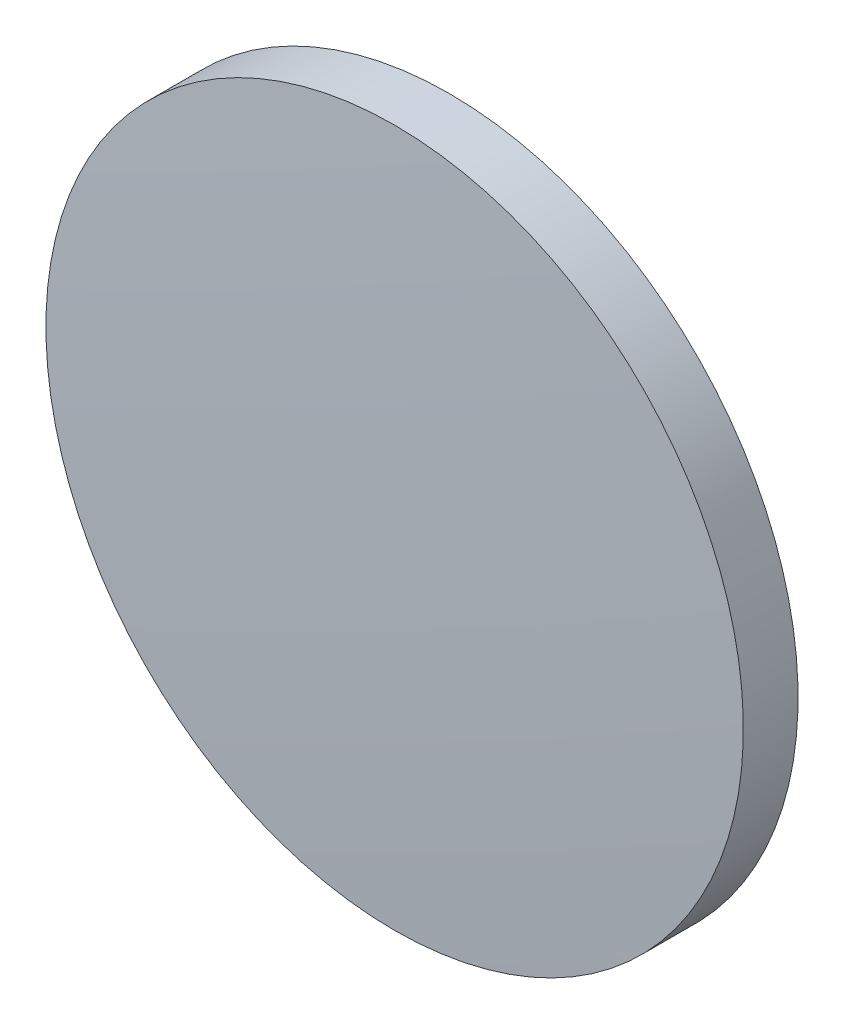
ISO-10303-21;
HEADER;
FILE_DESCRIPTION(('STEP AP214'),'2;1');
FILE_NAME('part.step','',(''),(''),'','','');
FILE_SCHEMA(('AUTOMOTIVE_DESIGN { 1 0 10303 214 1 1 1 1 }'));
ENDSEC;
DATA;
#1=APPLICATION_CONTEXT('core data for automotive mechanical design processes');
#2=APPLICATION_PROTOCOL_DEFINITION('international standard','automotive_design',2000,#1);
#3=PRODUCT_CONTEXT('',#1,'mechanical');
#4=PRODUCT('Part','Part','',(#3));
#5=PRODUCT_RELATED_PRODUCT_CATEGORY('part','',(#4));
#6=PRODUCT_DEFINITION_FORMATION('','',#4);
#7=PRODUCT_DEFINITION_CONTEXT('part definition',#1,'design');
#8=PRODUCT_DEFINITION('design','',#6,#7);
#9=PRODUCT_DEFINITION_SHAPE('','',#8);
#10=(LENGTH_UNIT() NAMED_UNIT(*) SI_UNIT(.MILLI.,.METRE.));
#11=(NAMED_UNIT(*) PLANE_ANGLE_UNIT() SI_UNIT($,.RADIAN.));
#12=(NAMED_UNIT(*) SI_UNIT($,.STERADIAN.) SOLID_ANGLE_UNIT());
#13=UNCERTAINTY_MEASURE_WITH_UNIT(LENGTH_MEASURE(1.E-05),#10,'distance_accuracy_value','');
#14=(GEOMETRIC_REPRESENTATION_CONTEXT(3) GLOBAL_UNCERTAINTY_ASSIGNED_CONTEXT((#13)) GLOBAL_UNIT_ASSIGNED_CONTEXT((#10,
#11,#12)) REPRESENTATION_CONTEXT('',''));
#15=CARTESIAN_POINT('',(0.,0.,0.));
#16=DIRECTION('',(0.,0.,1.));
#17=DIRECTION('',(1.,0.,0.));
#18=AXIS2_PLACEMENT_3D('',#15,#16,#17);
#19=CARTESIAN_POINT('',(0.,0.,-1.12));
#20=DIRECTION('',(0.,0.,-1.));
#21=DIRECTION('',(0.,1.,0.));
#22=AXIS2_PLACEMENT_3D('',#19,#20,#21);
#23=PLANE('',#22);
#24=CARTESIAN_POINT('',(0.,0.,-1.12));
#25=DIRECTION('',(0.,0.,-1.));
#26=DIRECTION('',(0.,1.,0.));
#27=AXIS2_PLACEMENT_3D('',#24,#25,#26);
#28=CIRCLE('',#27,12.7);
#29=CARTESIAN_POINT('',(0.,12.7,-1.12));
#30=VERTEX_POINT('',#29);
#31=EDGE_CURVE('E19',#30,#30,#28,.T.);
#32=ORIENTED_EDGE('',*,*,#31,.T.);
#33=EDGE_LOOP('',(#32));
#34=FACE_BOUND('',#33,.T.);
#35=ADVANCED_FACE('F13',(#34),#23,.T.);
#36=CARTESIAN_POINT('',(0.,0.,-324.29));
#37=DIRECTION('',(0.,0.,-1.));
#38=DIRECTION('',(0.,1.,0.));
#39=AXIS2_PLACEMENT_3D('',#36,#37,#38);
#40=SPHERICAL_SURFACE('',#39,325.41);
#41=CARTESIAN_POINT('',(0.,0.,0.872079738705008));
#42=DIRECTION('',(0.,0.,-1.));
#43=DIRECTION('',(0.,1.,0.));
#44=AXIS2_PLACEMENT_3D('',#41,#42,#43);
#45=CIRCLE('',#44,12.7);
#46=CARTESIAN_POINT('',(0.,12.7,0.872079738705012));
#47=VERTEX_POINT('',#46);
#48=EDGE_CURVE('E9',#47,#47,#45,.T.);
#49=ORIENTED_EDGE('',*,*,#48,.F.);
#50=EDGE_LOOP('',(#49));
#51=FACE_BOUND('',#50,.T.);
#52=ADVANCED_FACE('F28',(#51),#40,.T.);
#53=CARTESIAN_POINT('',(0.,0.,-1.12));
#54=DIRECTION('',(0.,0.,-1.));
#55=DIRECTION('',(0.,1.,0.));
#56=AXIS2_PLACEMENT_3D('',#53,#54,#55);
#57=CYLINDRICAL_SURFACE('',#56,12.7);
#58=ORIENTED_EDGE('',*,*,#48,.T.);
#59=EDGE_LOOP('',(#58));
#60=FACE_BOUND('',#59,.T.);
#61=ORIENTED_EDGE('',*,*,#31,.F.);
#62=EDGE_LOOP('',(#61));
#63=FACE_BOUND('',#62,.T.);
#64=ADVANCED_FACE('F26',(#60,#63),#57,.T.);
#65=CLOSED_SHELL('',(#35,#52,#64));
#66=MANIFOLD_SOLID_BREP('B1',#65);
#67=ADVANCED_BREP_SHAPE_REPRESENTATION('',(#18,#66),#14);
#68=SHAPE_DEFINITION_REPRESENTATION(#9,#67);
ENDSEC;
END-ISO-10303-21;
